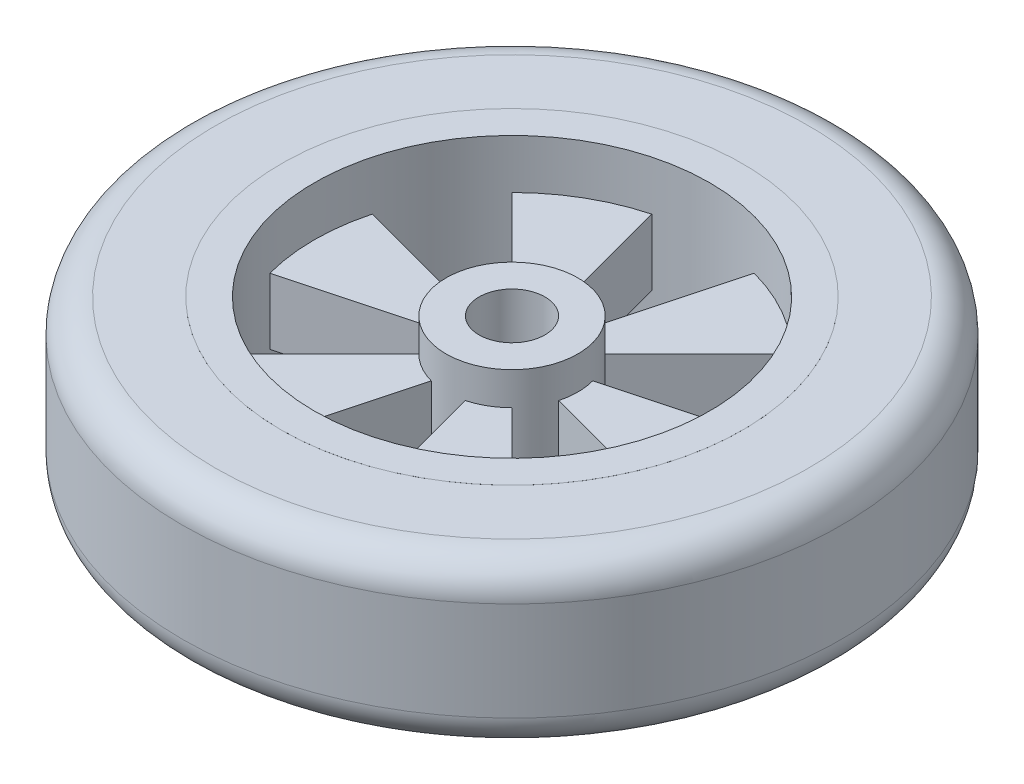
ISO-10303-21;
HEADER;
FILE_DESCRIPTION(('STEP AP214'),'2;1');
FILE_NAME('part.step','',(''),(''),'','','');
FILE_SCHEMA(('AUTOMOTIVE_DESIGN { 1 0 10303 214 1 1 1 1 }'));
ENDSEC;
DATA;
#1=APPLICATION_CONTEXT('core data for automotive mechanical design processes');
#2=APPLICATION_PROTOCOL_DEFINITION('international standard','automotive_design',2000,#1);
#3=PRODUCT_CONTEXT('',#1,'mechanical');
#4=PRODUCT('Part','Part','',(#3));
#5=PRODUCT_RELATED_PRODUCT_CATEGORY('part','',(#4));
#6=PRODUCT_DEFINITION_FORMATION('','',#4);
#7=PRODUCT_DEFINITION_CONTEXT('part definition',#1,'design');
#8=PRODUCT_DEFINITION('design','',#6,#7);
#9=PRODUCT_DEFINITION_SHAPE('','',#8);
#10=(LENGTH_UNIT() NAMED_UNIT(*) SI_UNIT(.MILLI.,.METRE.));
#11=(NAMED_UNIT(*) PLANE_ANGLE_UNIT() SI_UNIT($,.RADIAN.));
#12=(NAMED_UNIT(*) SI_UNIT($,.STERADIAN.) SOLID_ANGLE_UNIT());
#13=UNCERTAINTY_MEASURE_WITH_UNIT(LENGTH_MEASURE(1.E-05),#10,'distance_accuracy_value','');
#14=(GEOMETRIC_REPRESENTATION_CONTEXT(3) GLOBAL_UNCERTAINTY_ASSIGNED_CONTEXT((#13)) GLOBAL_UNIT_ASSIGNED_CONTEXT((#10,
#11,#12)) REPRESENTATION_CONTEXT('',''));
#15=CARTESIAN_POINT('',(0.,0.,0.));
#16=DIRECTION('',(0.,0.,1.));
#17=DIRECTION('',(1.,0.,0.));
#18=AXIS2_PLACEMENT_3D('',#15,#16,#17);
#19=CARTESIAN_POINT('',(0.,-10.,0.));
#20=DIRECTION('',(0.,1.,0.));
#21=DIRECTION('',(0.,0.,1.));
#22=AXIS2_PLACEMENT_3D('',#19,#20,#21);
#23=CYLINDRICAL_SURFACE('',#22,70.);
#24=CARTESIAN_POINT('',(0.,-25.,0.));
#25=DIRECTION('',(0.,1.,0.));
#26=DIRECTION('',(0.,0.,1.));
#27=AXIS2_PLACEMENT_3D('',#24,#25,#26);
#28=CIRCLE('',#27,70.);
#29=CARTESIAN_POINT('',(0.,-25.,70.));
#30=VERTEX_POINT('',#29);
#31=EDGE_CURVE('E326',#30,#30,#28,.T.);
#32=ORIENTED_EDGE('',*,*,#31,.T.);
#33=EDGE_LOOP('',(#32));
#34=FACE_BOUND('',#33,.T.);
#35=CARTESIAN_POINT('',(0.,-24.99,0.));
#36=DIRECTION('',(0.,1.,0.));
#37=DIRECTION('',(0.,0.,1.));
#38=AXIS2_PLACEMENT_3D('',#35,#36,#37);
#39=CIRCLE('',#38,70.);
#40=CARTESIAN_POINT('',(0.,-24.99,70.));
#41=VERTEX_POINT('',#40);
#42=EDGE_CURVE('E547',#41,#41,#39,.T.);
#43=ORIENTED_EDGE('',*,*,#42,.F.);
#44=EDGE_LOOP('',(#43));
#45=FACE_BOUND('',#44,.T.);
#46=ADVANCED_FACE('F35',(#34,#45),#23,.T.);
#47=CARTESIAN_POINT('',(0.,-10.,0.));
#48=DIRECTION('',(0.,1.,0.));
#49=DIRECTION('',(0.,0.,1.));
#50=AXIS2_PLACEMENT_3D('',#47,#48,#49);
#51=PLANE('',#50);
#52=DIRECTION('',(0.258819045102521,0.,-0.965925826289068));
#53=VECTOR('',#52,1.);
#54=CARTESIAN_POINT('',(0.,-10.,0.));
#55=LINE('',#54,#53);
#56=CARTESIAN_POINT('',(-15.5291427061513,-10.,57.9555495773441));
#57=VERTEX_POINT('',#56);
#58=CARTESIAN_POINT('',(-5.17638090205042,-10.,19.3185165257814));
#59=VERTEX_POINT('',#58);
#60=EDGE_CURVE('E283',#57,#59,#55,.T.);
#61=ORIENTED_EDGE('',*,*,#60,.F.);
#62=CARTESIAN_POINT('',(0.,-10.,0.));
#63=DIRECTION('',(0.,1.,0.));
#64=DIRECTION('',(0.,0.,1.));
#65=AXIS2_PLACEMENT_3D('',#62,#63,#64);
#66=CIRCLE('',#65,60.);
#67=CARTESIAN_POINT('',(-42.4264068711935,-10.,42.4264068711922));
#68=VERTEX_POINT('',#67);
#69=EDGE_CURVE('E239',#68,#57,#66,.T.);
#70=ORIENTED_EDGE('',*,*,#69,.F.);
#71=DIRECTION('',(-0.707106781186559,0.,0.707106781186536));
#72=VECTOR('',#71,1.);
#73=CARTESIAN_POINT('',(0.,-10.,0.));
#74=LINE('',#73,#72);
#75=CARTESIAN_POINT('',(-14.1421356237312,-10.,14.1421356237307));
#76=VERTEX_POINT('',#75);
#77=EDGE_CURVE('E502',#76,#68,#74,.T.);
#78=ORIENTED_EDGE('',*,*,#77,.F.);
#79=CARTESIAN_POINT('',(0.,-10.,0.));
#80=DIRECTION('',(0.,1.,0.));
#81=DIRECTION('',(0.,0.,1.));
#82=AXIS2_PLACEMENT_3D('',#79,#80,#81);
#83=CIRCLE('',#82,20.);
#84=EDGE_CURVE('E474',#76,#59,#83,.T.);
#85=ORIENTED_EDGE('',*,*,#84,.T.);
#86=EDGE_LOOP('',(#61,#70,#78,#85));
#87=FACE_BOUND('',#86,.T.);
#88=ADVANCED_FACE('F402',(#87),#51,.F.);
#89=DIRECTION('',(0.258819045102514,0.,0.96592582628907));
#90=VECTOR('',#89,1.);
#91=CARTESIAN_POINT('',(0.,-10.,0.));
#92=LINE('',#91,#90);
#93=CARTESIAN_POINT('',(5.1763809020503,-10.,19.3185165257814));
#94=VERTEX_POINT('',#93);
#95=CARTESIAN_POINT('',(15.5291427061509,-10.,57.9555495773442));
#96=VERTEX_POINT('',#95);
#97=EDGE_CURVE('E263',#94,#96,#92,.T.);
#98=ORIENTED_EDGE('',*,*,#97,.F.);
#99=CARTESIAN_POINT('',(14.1421356237309,-10.,14.142135623731));
#100=VERTEX_POINT('',#99);
#101=EDGE_CURVE('E266',#94,#100,#83,.T.);
#102=ORIENTED_EDGE('',*,*,#101,.T.);
#103=DIRECTION('',(-0.707106781186544,0.,-0.707106781186551));
#104=VECTOR('',#103,1.);
#105=CARTESIAN_POINT('',(0.,-10.,0.));
#106=LINE('',#105,#104);
#107=CARTESIAN_POINT('',(42.4264068711927,-10.,42.4264068711931));
#108=VERTEX_POINT('',#107);
#109=EDGE_CURVE('E265',#108,#100,#106,.T.);
#110=ORIENTED_EDGE('',*,*,#109,.F.);
#111=EDGE_CURVE('E223',#96,#108,#66,.T.);
#112=ORIENTED_EDGE('',*,*,#111,.F.);
#113=EDGE_LOOP('',(#98,#102,#110,#112));
#114=FACE_BOUND('',#113,.T.);
#115=ADVANCED_FACE('F261',(#114),#51,.F.);
#116=DIRECTION('',(0.965925826289066,0.,0.258819045102532));
#117=VECTOR('',#116,1.);
#118=CARTESIAN_POINT('',(0.,-10.,0.));
#119=LINE('',#118,#117);
#120=CARTESIAN_POINT('',(19.3185165257813,-10.,5.17638090205062));
#121=VERTEX_POINT('',#120);
#122=CARTESIAN_POINT('',(57.955549577344,-10.,15.5291427061519));
#123=VERTEX_POINT('',#122);
#124=EDGE_CURVE('E275',#121,#123,#119,.T.);
#125=ORIENTED_EDGE('',*,*,#124,.F.);
#126=CARTESIAN_POINT('',(19.3185165257814,-10.,-5.17638090205037));
#127=VERTEX_POINT('',#126);
#128=EDGE_CURVE('E468',#121,#127,#83,.T.);
#129=ORIENTED_EDGE('',*,*,#128,.T.);
#130=DIRECTION('',(-0.965925826289069,0.,0.258819045102518));
#131=VECTOR('',#130,1.);
#132=CARTESIAN_POINT('',(0.,-10.,0.));
#133=LINE('',#132,#131);
#134=CARTESIAN_POINT('',(57.9555495773442,-10.,-15.5291427061511));
#135=VERTEX_POINT('',#134);
#136=EDGE_CURVE('E493',#135,#127,#133,.T.);
#137=ORIENTED_EDGE('',*,*,#136,.F.);
#138=EDGE_CURVE('E218',#123,#135,#66,.T.);
#139=ORIENTED_EDGE('',*,*,#138,.F.);
#140=EDGE_LOOP('',(#125,#129,#137,#139));
#141=FACE_BOUND('',#140,.T.);
#142=ADVANCED_FACE('F491',(#141),#51,.F.);
#143=DIRECTION('',(0.965925826289071,0.,-0.258819045102511));
#144=VECTOR('',#143,1.);
#145=CARTESIAN_POINT('',(0.,-10.,0.));
#146=LINE('',#145,#144);
#147=CARTESIAN_POINT('',(-57.9555495773443,-10.,15.5291427061507));
#148=VERTEX_POINT('',#147);
#149=CARTESIAN_POINT('',(-19.3185165257814,-10.,5.17638090205023));
#150=VERTEX_POINT('',#149);
#151=EDGE_CURVE('E495',#148,#150,#146,.T.);
#152=ORIENTED_EDGE('',*,*,#151,.F.);
#153=CARTESIAN_POINT('',(-57.9555495773438,-10.,-15.5291427061523));
#154=VERTEX_POINT('',#153);
#155=EDGE_CURVE('E230',#154,#148,#66,.T.);
#156=ORIENTED_EDGE('',*,*,#155,.F.);
#157=DIRECTION('',(-0.965925826289064,0.,-0.258819045102538));
#158=VECTOR('',#157,1.);
#159=CARTESIAN_POINT('',(0.,-10.,0.));
#160=LINE('',#159,#158);
#161=CARTESIAN_POINT('',(-19.3185165257813,-10.,-5.17638090205076));
#162=VERTEX_POINT('',#161);
#163=EDGE_CURVE('E512',#162,#154,#160,.T.);
#164=ORIENTED_EDGE('',*,*,#163,.F.);
#165=EDGE_CURVE('E318',#162,#150,#83,.T.);
#166=ORIENTED_EDGE('',*,*,#165,.T.);
#167=EDGE_LOOP('',(#152,#156,#164,#166));
#168=FACE_BOUND('',#167,.T.);
#169=ADVANCED_FACE('F610',(#168),#51,.F.);
#170=DIRECTION('',(0.707106781186539,0.,0.707106781186556));
#171=VECTOR('',#170,1.);
#172=CARTESIAN_POINT('',(0.,-10.,0.));
#173=LINE('',#172,#171);
#174=CARTESIAN_POINT('',(-42.4264068711924,-10.,-42.4264068711934));
#175=VERTEX_POINT('',#174);
#176=CARTESIAN_POINT('',(-14.1421356237308,-10.,-14.1421356237311));
#177=VERTEX_POINT('',#176);
#178=EDGE_CURVE('E507',#175,#177,#173,.T.);
#179=ORIENTED_EDGE('',*,*,#178,.F.);
#180=CARTESIAN_POINT('',(-15.5291427061509,-10.,-57.9555495773442));
#181=VERTEX_POINT('',#180);
#182=EDGE_CURVE('E221',#181,#175,#66,.T.);
#183=ORIENTED_EDGE('',*,*,#182,.F.);
#184=DIRECTION('',(-0.258819045102514,0.,-0.96592582628907));
#185=VECTOR('',#184,1.);
#186=CARTESIAN_POINT('',(0.,-10.,0.));
#187=LINE('',#186,#185);
#188=CARTESIAN_POINT('',(-5.1763809020503,-10.,-19.3185165257814));
#189=VERTEX_POINT('',#188);
#190=EDGE_CURVE('E297',#189,#181,#187,.T.);
#191=ORIENTED_EDGE('',*,*,#190,.F.);
#192=EDGE_CURVE('E314',#189,#177,#83,.T.);
#193=ORIENTED_EDGE('',*,*,#192,.T.);
#194=EDGE_LOOP('',(#179,#183,#191,#193));
#195=FACE_BOUND('',#194,.T.);
#196=ADVANCED_FACE('F419',(#195),#51,.F.);
#197=DIRECTION('',(0.707106781186554,0.,-0.707106781186541));
#198=VECTOR('',#197,1.);
#199=CARTESIAN_POINT('',(0.,-10.,0.));
#200=LINE('',#199,#198);
#201=CARTESIAN_POINT('',(14.1421356237311,-10.,-14.1421356237308));
#202=VERTEX_POINT('',#201);
#203=CARTESIAN_POINT('',(42.4264068711932,-10.,-42.4264068711925));
#204=VERTEX_POINT('',#203);
#205=EDGE_CURVE('E194',#202,#204,#200,.T.);
#206=ORIENTED_EDGE('',*,*,#205,.F.);
#207=CARTESIAN_POINT('',(5.17638090205042,-10.,-19.3185165257814));
#208=VERTEX_POINT('',#207);
#209=EDGE_CURVE('E313',#202,#208,#83,.T.);
#210=ORIENTED_EDGE('',*,*,#209,.T.);
#211=DIRECTION('',(-0.258819045102521,0.,0.965925826289068));
#212=VECTOR('',#211,1.);
#213=CARTESIAN_POINT('',(0.,-10.,0.));
#214=LINE('',#213,#212);
#215=CARTESIAN_POINT('',(15.5291427061513,-10.,-57.9555495773441));
#216=VERTEX_POINT('',#215);
#217=EDGE_CURVE('E217',#216,#208,#214,.T.);
#218=ORIENTED_EDGE('',*,*,#217,.F.);
#219=EDGE_CURVE('E209',#204,#216,#66,.T.);
#220=ORIENTED_EDGE('',*,*,#219,.F.);
#221=EDGE_LOOP('',(#206,#210,#218,#220));
#222=FACE_BOUND('',#221,.T.);
#223=ADVANCED_FACE('F215',(#222),#51,.F.);
#224=CARTESIAN_POINT('',(0.,10.,0.));
#225=DIRECTION('',(0.,1.,0.));
#226=DIRECTION('',(0.,0.,1.));
#227=AXIS2_PLACEMENT_3D('',#224,#225,#226);
#228=PLANE('',#227);
#229=CARTESIAN_POINT('',(0.,10.,0.));
#230=DIRECTION('',(0.,1.,0.));
#231=DIRECTION('',(0.,0.,1.));
#232=AXIS2_PLACEMENT_3D('',#229,#230,#231);
#233=CIRCLE('',#232,60.);
#234=CARTESIAN_POINT('',(-42.4264068711935,10.,42.4264068711922));
#235=VERTEX_POINT('',#234);
#236=CARTESIAN_POINT('',(-15.5291427061513,10.,57.9555495773441));
#237=VERTEX_POINT('',#236);
#238=EDGE_CURVE('E608',#235,#237,#233,.T.);
#239=ORIENTED_EDGE('',*,*,#238,.T.);
#240=DIRECTION('',(0.258819045102521,0.,-0.965925826289068));
#241=VECTOR('',#240,1.);
#242=CARTESIAN_POINT('',(0.,10.,0.));
#243=LINE('',#242,#241);
#244=CARTESIAN_POINT('',(-5.17638090205042,10.,19.3185165257814));
#245=VERTEX_POINT('',#244);
#246=EDGE_CURVE('E280',#237,#245,#243,.T.);
#247=ORIENTED_EDGE('',*,*,#246,.T.);
#248=CARTESIAN_POINT('',(0.,10.,0.));
#249=DIRECTION('',(0.,1.,0.));
#250=DIRECTION('',(0.,0.,1.));
#251=AXIS2_PLACEMENT_3D('',#248,#249,#250);
#252=CIRCLE('',#251,20.);
#253=CARTESIAN_POINT('',(-14.1421356237312,10.,14.1421356237307));
#254=VERTEX_POINT('',#253);
#255=EDGE_CURVE('E601',#254,#245,#252,.T.);
#256=ORIENTED_EDGE('',*,*,#255,.F.);
#257=DIRECTION('',(-0.707106781186559,0.,0.707106781186536));
#258=VECTOR('',#257,1.);
#259=CARTESIAN_POINT('',(0.,10.,0.));
#260=LINE('',#259,#258);
#261=EDGE_CURVE('E504',#254,#235,#260,.T.);
#262=ORIENTED_EDGE('',*,*,#261,.T.);
#263=EDGE_LOOP('',(#239,#247,#256,#262));
#264=FACE_BOUND('',#263,.T.);
#265=ADVANCED_FACE('F409',(#264),#228,.T.);
#266=CARTESIAN_POINT('',(5.1763809020503,10.,19.3185165257814));
#267=VERTEX_POINT('',#266);
#268=CARTESIAN_POINT('',(14.1421356237309,10.,14.142135623731));
#269=VERTEX_POINT('',#268);
#270=EDGE_CURVE('E599',#267,#269,#252,.T.);
#271=ORIENTED_EDGE('',*,*,#270,.F.);
#272=DIRECTION('',(0.258819045102514,0.,0.96592582628907));
#273=VECTOR('',#272,1.);
#274=CARTESIAN_POINT('',(0.,10.,0.));
#275=LINE('',#274,#273);
#276=CARTESIAN_POINT('',(15.5291427061509,10.,57.9555495773442));
#277=VERTEX_POINT('',#276);
#278=EDGE_CURVE('E269',#267,#277,#275,.T.);
#279=ORIENTED_EDGE('',*,*,#278,.T.);
#280=CARTESIAN_POINT('',(42.4264068711927,10.,42.4264068711931));
#281=VERTEX_POINT('',#280);
#282=EDGE_CURVE('E334',#277,#281,#233,.T.);
#283=ORIENTED_EDGE('',*,*,#282,.T.);
#284=DIRECTION('',(-0.707106781186544,0.,-0.707106781186551));
#285=VECTOR('',#284,1.);
#286=CARTESIAN_POINT('',(0.,10.,0.));
#287=LINE('',#286,#285);
#288=EDGE_CURVE('E270',#281,#269,#287,.T.);
#289=ORIENTED_EDGE('',*,*,#288,.T.);
#290=EDGE_LOOP('',(#271,#279,#283,#289));
#291=FACE_BOUND('',#290,.T.);
#292=ADVANCED_FACE('F411',(#291),#228,.T.);
#293=CARTESIAN_POINT('',(19.3185165257813,10.,5.17638090205062));
#294=VERTEX_POINT('',#293);
#295=CARTESIAN_POINT('',(19.3185165257814,10.,-5.17638090205037));
#296=VERTEX_POINT('',#295);
#297=EDGE_CURVE('E235',#294,#296,#252,.T.);
#298=ORIENTED_EDGE('',*,*,#297,.F.);
#299=DIRECTION('',(0.965925826289066,0.,0.258819045102532));
#300=VECTOR('',#299,1.);
#301=CARTESIAN_POINT('',(0.,10.,0.));
#302=LINE('',#301,#300);
#303=CARTESIAN_POINT('',(57.955549577344,10.,15.5291427061519));
#304=VERTEX_POINT('',#303);
#305=EDGE_CURVE('E494',#294,#304,#302,.T.);
#306=ORIENTED_EDGE('',*,*,#305,.T.);
#307=CARTESIAN_POINT('',(57.9555495773442,10.,-15.5291427061511));
#308=VERTEX_POINT('',#307);
#309=EDGE_CURVE('E330',#304,#308,#233,.T.);
#310=ORIENTED_EDGE('',*,*,#309,.T.);
#311=DIRECTION('',(-0.965925826289069,0.,0.258819045102518));
#312=VECTOR('',#311,1.);
#313=CARTESIAN_POINT('',(0.,10.,0.));
#314=LINE('',#313,#312);
#315=EDGE_CURVE('E201',#308,#296,#314,.T.);
#316=ORIENTED_EDGE('',*,*,#315,.T.);
#317=EDGE_LOOP('',(#298,#306,#310,#316));
#318=FACE_BOUND('',#317,.T.);
#319=ADVANCED_FACE('F417',(#318),#228,.T.);
#320=CARTESIAN_POINT('',(-57.9555495773438,10.,-15.5291427061523));
#321=VERTEX_POINT('',#320);
#322=CARTESIAN_POINT('',(-57.9555495773443,10.,15.5291427061507));
#323=VERTEX_POINT('',#322);
#324=EDGE_CURVE('E225',#321,#323,#233,.T.);
#325=ORIENTED_EDGE('',*,*,#324,.T.);
#326=DIRECTION('',(0.965925826289071,0.,-0.258819045102511));
#327=VECTOR('',#326,1.);
#328=CARTESIAN_POINT('',(0.,10.,0.));
#329=LINE('',#328,#327);
#330=CARTESIAN_POINT('',(-19.3185165257814,10.,5.17638090205023));
#331=VERTEX_POINT('',#330);
#332=EDGE_CURVE('E499',#323,#331,#329,.T.);
#333=ORIENTED_EDGE('',*,*,#332,.T.);
#334=CARTESIAN_POINT('',(-19.3185165257813,10.,-5.17638090205076));
#335=VERTEX_POINT('',#334);
#336=EDGE_CURVE('E338',#335,#331,#252,.T.);
#337=ORIENTED_EDGE('',*,*,#336,.F.);
#338=DIRECTION('',(-0.965925826289064,0.,-0.258819045102538));
#339=VECTOR('',#338,1.);
#340=CARTESIAN_POINT('',(0.,10.,0.));
#341=LINE('',#340,#339);
#342=EDGE_CURVE('E514',#335,#321,#341,.T.);
#343=ORIENTED_EDGE('',*,*,#342,.T.);
#344=EDGE_LOOP('',(#325,#333,#337,#343));
#345=FACE_BOUND('',#344,.T.);
#346=ADVANCED_FACE('F426',(#345),#228,.T.);
#347=CARTESIAN_POINT('',(-15.5291427061509,10.,-57.9555495773442));
#348=VERTEX_POINT('',#347);
#349=CARTESIAN_POINT('',(-42.4264068711924,10.,-42.4264068711934));
#350=VERTEX_POINT('',#349);
#351=EDGE_CURVE('E219',#348,#350,#233,.T.);
#352=ORIENTED_EDGE('',*,*,#351,.T.);
#353=DIRECTION('',(0.707106781186539,0.,0.707106781186556));
#354=VECTOR('',#353,1.);
#355=CARTESIAN_POINT('',(0.,10.,0.));
#356=LINE('',#355,#354);
#357=CARTESIAN_POINT('',(-14.1421356237308,10.,-14.1421356237311));
#358=VERTEX_POINT('',#357);
#359=EDGE_CURVE('E509',#350,#358,#356,.T.);
#360=ORIENTED_EDGE('',*,*,#359,.T.);
#361=CARTESIAN_POINT('',(-5.1763809020503,10.,-19.3185165257814));
#362=VERTEX_POINT('',#361);
#363=EDGE_CURVE('E237',#362,#358,#252,.T.);
#364=ORIENTED_EDGE('',*,*,#363,.F.);
#365=DIRECTION('',(-0.258819045102514,0.,-0.96592582628907));
#366=VECTOR('',#365,1.);
#367=CARTESIAN_POINT('',(0.,10.,0.));
#368=LINE('',#367,#366);
#369=EDGE_CURVE('E294',#362,#348,#368,.T.);
#370=ORIENTED_EDGE('',*,*,#369,.T.);
#371=EDGE_LOOP('',(#352,#360,#364,#370));
#372=FACE_BOUND('',#371,.T.);
#373=ADVANCED_FACE('F422',(#372),#228,.T.);
#374=CARTESIAN_POINT('',(14.1421356237311,10.,-14.1421356237308));
#375=VERTEX_POINT('',#374);
#376=CARTESIAN_POINT('',(5.17638090205042,10.,-19.3185165257814));
#377=VERTEX_POINT('',#376);
#378=EDGE_CURVE('E229',#375,#377,#252,.T.);
#379=ORIENTED_EDGE('',*,*,#378,.F.);
#380=DIRECTION('',(0.707106781186554,0.,-0.707106781186541));
#381=VECTOR('',#380,1.);
#382=CARTESIAN_POINT('',(0.,10.,0.));
#383=LINE('',#382,#381);
#384=CARTESIAN_POINT('',(42.4264068711932,10.,-42.4264068711925));
#385=VERTEX_POINT('',#384);
#386=EDGE_CURVE('E202',#375,#385,#383,.T.);
#387=ORIENTED_EDGE('',*,*,#386,.T.);
#388=CARTESIAN_POINT('',(15.5291427061513,10.,-57.9555495773441));
#389=VERTEX_POINT('',#388);
#390=EDGE_CURVE('E211',#385,#389,#233,.T.);
#391=ORIENTED_EDGE('',*,*,#390,.T.);
#392=DIRECTION('',(-0.258819045102521,0.,0.965925826289068));
#393=VECTOR('',#392,1.);
#394=CARTESIAN_POINT('',(0.,10.,0.));
#395=LINE('',#394,#393);
#396=EDGE_CURVE('E299',#389,#377,#395,.T.);
#397=ORIENTED_EDGE('',*,*,#396,.T.);
#398=EDGE_LOOP('',(#379,#387,#391,#397));
#399=FACE_BOUND('',#398,.T.);
#400=ADVANCED_FACE('F391',(#399),#228,.T.);
#401=CARTESIAN_POINT('',(0.,-25.,0.));
#402=DIRECTION('',(0.,1.,0.));
#403=DIRECTION('',(0.,0.,1.));
#404=AXIS2_PLACEMENT_3D('',#401,#402,#403);
#405=CYLINDRICAL_SURFACE('',#404,60.);
#406=ORIENTED_EDGE('',*,*,#69,.T.);
#407=DIRECTION('',(0.,-1.,0.));
#408=VECTOR('',#407,1.);
#409=CARTESIAN_POINT('',(-15.5291427061513,25.,57.9555495773441));
#410=LINE('',#409,#408);
#411=EDGE_CURVE('E533',#237,#57,#410,.T.);
#412=ORIENTED_EDGE('',*,*,#411,.F.);
#413=ORIENTED_EDGE('',*,*,#238,.F.);
#414=DIRECTION('',(0.,-1.,0.));
#415=VECTOR('',#414,1.);
#416=CARTESIAN_POINT('',(-42.4264068711935,25.,42.4264068711922));
#417=LINE('',#416,#415);
#418=EDGE_CURVE('E551',#235,#68,#417,.T.);
#419=ORIENTED_EDGE('',*,*,#418,.T.);
#420=EDGE_LOOP('',(#406,#412,#413,#419));
#421=FACE_BOUND('',#420,.T.);
#422=ORIENTED_EDGE('',*,*,#111,.T.);
#423=DIRECTION('',(0.,-1.,0.));
#424=VECTOR('',#423,1.);
#425=CARTESIAN_POINT('',(42.4264068711927,25.,42.4264068711931));
#426=LINE('',#425,#424);
#427=EDGE_CURVE('E255',#281,#108,#426,.T.);
#428=ORIENTED_EDGE('',*,*,#427,.F.);
#429=ORIENTED_EDGE('',*,*,#282,.F.);
#430=DIRECTION('',(0.,-1.,0.));
#431=VECTOR('',#430,1.);
#432=CARTESIAN_POINT('',(15.5291427061509,25.,57.9555495773442));
#433=LINE('',#432,#431);
#434=EDGE_CURVE('E257',#277,#96,#433,.T.);
#435=ORIENTED_EDGE('',*,*,#434,.T.);
#436=EDGE_LOOP('',(#422,#428,#429,#435));
#437=FACE_BOUND('',#436,.T.);
#438=ORIENTED_EDGE('',*,*,#155,.T.);
#439=DIRECTION('',(0.,-1.,0.));
#440=VECTOR('',#439,1.);
#441=CARTESIAN_POINT('',(-57.9555495773443,25.,15.5291427061507));
#442=LINE('',#441,#440);
#443=EDGE_CURVE('E549',#323,#148,#442,.T.);
#444=ORIENTED_EDGE('',*,*,#443,.F.);
#445=ORIENTED_EDGE('',*,*,#324,.F.);
#446=DIRECTION('',(0.,-1.,0.));
#447=VECTOR('',#446,1.);
#448=CARTESIAN_POINT('',(-57.9555495773438,25.,-15.5291427061523));
#449=LINE('',#448,#447);
#450=EDGE_CURVE('E544',#321,#154,#449,.T.);
#451=ORIENTED_EDGE('',*,*,#450,.T.);
#452=EDGE_LOOP('',(#438,#444,#445,#451));
#453=FACE_BOUND('',#452,.T.);
#454=ORIENTED_EDGE('',*,*,#182,.T.);
#455=DIRECTION('',(0.,-1.,0.));
#456=VECTOR('',#455,1.);
#457=CARTESIAN_POINT('',(-42.4264068711924,25.,-42.4264068711934));
#458=LINE('',#457,#456);
#459=EDGE_CURVE('E542',#350,#175,#458,.T.);
#460=ORIENTED_EDGE('',*,*,#459,.F.);
#461=ORIENTED_EDGE('',*,*,#351,.F.);
#462=DIRECTION('',(0.,-1.,0.));
#463=VECTOR('',#462,1.);
#464=CARTESIAN_POINT('',(-15.5291427061509,25.,-57.9555495773442));
#465=LINE('',#464,#463);
#466=EDGE_CURVE('E287',#348,#181,#465,.T.);
#467=ORIENTED_EDGE('',*,*,#466,.T.);
#468=EDGE_LOOP('',(#454,#460,#461,#467));
#469=FACE_BOUND('',#468,.T.);
#470=ORIENTED_EDGE('',*,*,#138,.T.);
#471=DIRECTION('',(0.,-1.,0.));
#472=VECTOR('',#471,1.);
#473=CARTESIAN_POINT('',(57.9555495773442,25.,-15.5291427061511));
#474=LINE('',#473,#472);
#475=EDGE_CURVE('E212',#308,#135,#474,.T.);
#476=ORIENTED_EDGE('',*,*,#475,.F.);
#477=ORIENTED_EDGE('',*,*,#309,.F.);
#478=DIRECTION('',(0.,-1.,0.));
#479=VECTOR('',#478,1.);
#480=CARTESIAN_POINT('',(57.955549577344,25.,15.5291427061519));
#481=LINE('',#480,#479);
#482=EDGE_CURVE('E58',#304,#123,#481,.T.);
#483=ORIENTED_EDGE('',*,*,#482,.T.);
#484=EDGE_LOOP('',(#470,#476,#477,#483));
#485=FACE_BOUND('',#484,.T.);
#486=DIRECTION('',(0.,-1.,0.));
#487=VECTOR('',#486,1.);
#488=CARTESIAN_POINT('',(42.4264068711932,25.,-42.4264068711925));
#489=LINE('',#488,#487);
#490=EDGE_CURVE('E50',#385,#204,#489,.T.);
#491=ORIENTED_EDGE('',*,*,#490,.T.);
#492=ORIENTED_EDGE('',*,*,#219,.T.);
#493=DIRECTION('',(0.,-1.,0.));
#494=VECTOR('',#493,1.);
#495=CARTESIAN_POINT('',(15.5291427061513,25.,-57.9555495773441));
#496=LINE('',#495,#494);
#497=EDGE_CURVE('E289',#389,#216,#496,.T.);
#498=ORIENTED_EDGE('',*,*,#497,.F.);
#499=ORIENTED_EDGE('',*,*,#390,.F.);
#500=EDGE_LOOP('',(#491,#492,#498,#499));
#501=FACE_BOUND('',#500,.T.);
#502=CARTESIAN_POINT('',(0.,25.,0.));
#503=DIRECTION('',(0.,1.,0.));
#504=DIRECTION('',(0.,0.,1.));
#505=AXIS2_PLACEMENT_3D('',#502,#503,#504);
#506=CIRCLE('',#505,60.);
#507=CARTESIAN_POINT('',(0.,25.,60.));
#508=VERTEX_POINT('',#507);
#509=EDGE_CURVE('E317',#508,#508,#506,.T.);
#510=ORIENTED_EDGE('',*,*,#509,.T.);
#511=EDGE_LOOP('',(#510));
#512=FACE_BOUND('',#511,.T.);
#513=CARTESIAN_POINT('',(0.,-25.,0.));
#514=DIRECTION('',(0.,1.,0.));
#515=DIRECTION('',(0.,0.,1.));
#516=AXIS2_PLACEMENT_3D('',#513,#514,#515);
#517=CIRCLE('',#516,60.);
#518=CARTESIAN_POINT('',(0.,-25.,60.));
#519=VERTEX_POINT('',#518);
#520=EDGE_CURVE('E324',#519,#519,#517,.T.);
#521=ORIENTED_EDGE('',*,*,#520,.F.);
#522=EDGE_LOOP('',(#521));
#523=FACE_BOUND('',#522,.T.);
#524=ADVANCED_FACE('F206',(#421,#437,#453,#469,#485,#501,#512,#523),#405,.F.);
#525=CARTESIAN_POINT('',(0.,-25.,0.));
#526=DIRECTION('',(0.,1.,0.));
#527=DIRECTION('',(0.,0.,1.));
#528=AXIS2_PLACEMENT_3D('',#525,#526,#527);
#529=PLANE('',#528);
#530=ORIENTED_EDGE('',*,*,#520,.T.);
#531=EDGE_LOOP('',(#530));
#532=FACE_BOUND('',#531,.T.);
#533=ORIENTED_EDGE('',*,*,#31,.F.);
#534=EDGE_LOOP('',(#533));
#535=FACE_BOUND('',#534,.T.);
#536=ADVANCED_FACE('F380',(#532,#535),#529,.F.);
#537=CARTESIAN_POINT('',(0.,24.99,0.));
#538=DIRECTION('',(0.,1.,0.));
#539=DIRECTION('',(0.,0.,1.));
#540=AXIS2_PLACEMENT_3D('',#537,#538,#539);
#541=CIRCLE('',#540,70.);
#542=CARTESIAN_POINT('',(0.,24.99,70.));
#543=VERTEX_POINT('',#542);
#544=EDGE_CURVE('E337',#543,#543,#541,.F.);
#545=ORIENTED_EDGE('',*,*,#544,.F.);
#546=EDGE_LOOP('',(#545));
#547=FACE_BOUND('',#546,.T.);
#548=CARTESIAN_POINT('',(0.,25.,0.));
#549=DIRECTION('',(0.,1.,0.));
#550=DIRECTION('',(0.,0.,1.));
#551=AXIS2_PLACEMENT_3D('',#548,#549,#550);
#552=CIRCLE('',#551,70.);
#553=CARTESIAN_POINT('',(0.,25.,70.));
#554=VERTEX_POINT('',#553);
#555=EDGE_CURVE('E321',#554,#554,#552,.T.);
#556=ORIENTED_EDGE('',*,*,#555,.F.);
#557=EDGE_LOOP('',(#556));
#558=FACE_BOUND('',#557,.T.);
#559=ADVANCED_FACE('F376',(#547,#558),#23,.T.);
#560=CARTESIAN_POINT('',(0.,25.,0.));
#561=DIRECTION('',(0.,1.,0.));
#562=DIRECTION('',(0.,0.,1.));
#563=AXIS2_PLACEMENT_3D('',#560,#561,#562);
#564=PLANE('',#563);
#565=ORIENTED_EDGE('',*,*,#555,.T.);
#566=EDGE_LOOP('',(#565));
#567=FACE_BOUND('',#566,.T.);
#568=ORIENTED_EDGE('',*,*,#509,.F.);
#569=EDGE_LOOP('',(#568));
#570=FACE_BOUND('',#569,.T.);
#571=ADVANCED_FACE('F379',(#567,#570),#564,.T.);
#572=CARTESIAN_POINT('',(0.,20.,0.));
#573=DIRECTION('',(0.,1.,0.));
#574=DIRECTION('',(0.,0.,1.));
#575=AXIS2_PLACEMENT_3D('',#572,#573,#574);
#576=PLANE('',#575);
#577=CARTESIAN_POINT('',(0.,20.,0.));
#578=DIRECTION('',(0.,1.,0.));
#579=DIRECTION('',(0.,0.,1.));
#580=AXIS2_PLACEMENT_3D('',#577,#578,#579);
#581=CIRCLE('',#580,10.);
#582=CARTESIAN_POINT('',(0.,20.,10.));
#583=VERTEX_POINT('',#582);
#584=EDGE_CURVE('E304',#583,#583,#581,.F.);
#585=ORIENTED_EDGE('',*,*,#584,.T.);
#586=EDGE_LOOP('',(#585));
#587=FACE_BOUND('',#586,.T.);
#588=CARTESIAN_POINT('',(0.,20.,0.));
#589=DIRECTION('',(0.,1.,0.));
#590=DIRECTION('',(0.,0.,1.));
#591=AXIS2_PLACEMENT_3D('',#588,#589,#590);
#592=CIRCLE('',#591,20.);
#593=CARTESIAN_POINT('',(0.,20.,20.));
#594=VERTEX_POINT('',#593);
#595=EDGE_CURVE('E307',#594,#594,#592,.T.);
#596=ORIENTED_EDGE('',*,*,#595,.T.);
#597=EDGE_LOOP('',(#596));
#598=FACE_BOUND('',#597,.T.);
#599=ADVANCED_FACE('F386',(#587,#598),#576,.T.);
#600=CARTESIAN_POINT('',(0.,-20.,0.));
#601=DIRECTION('',(0.,1.,0.));
#602=DIRECTION('',(0.,0.,1.));
#603=AXIS2_PLACEMENT_3D('',#600,#601,#602);
#604=CYLINDRICAL_SURFACE('',#603,20.);
#605=ORIENTED_EDGE('',*,*,#101,.F.);
#606=DIRECTION('',(0.,-1.,0.));
#607=VECTOR('',#606,1.);
#608=CARTESIAN_POINT('',(5.1763809020503,25.,19.3185165257814));
#609=LINE('',#608,#607);
#610=EDGE_CURVE('E536',#267,#94,#609,.T.);
#611=ORIENTED_EDGE('',*,*,#610,.F.);
#612=ORIENTED_EDGE('',*,*,#270,.T.);
#613=DIRECTION('',(0.,-1.,0.));
#614=VECTOR('',#613,1.);
#615=CARTESIAN_POINT('',(14.1421356237309,25.,14.142135623731));
#616=LINE('',#615,#614);
#617=EDGE_CURVE('E525',#269,#100,#616,.T.);
#618=ORIENTED_EDGE('',*,*,#617,.T.);
#619=EDGE_LOOP('',(#605,#611,#612,#618));
#620=FACE_BOUND('',#619,.T.);
#621=ORIENTED_EDGE('',*,*,#128,.F.);
#622=DIRECTION('',(0.,-1.,0.));
#623=VECTOR('',#622,1.);
#624=CARTESIAN_POINT('',(19.3185165257813,25.,5.17638090205062));
#625=LINE('',#624,#623);
#626=EDGE_CURVE('E529',#294,#121,#625,.T.);
#627=ORIENTED_EDGE('',*,*,#626,.F.);
#628=ORIENTED_EDGE('',*,*,#297,.T.);
#629=DIRECTION('',(0.,-1.,0.));
#630=VECTOR('',#629,1.);
#631=CARTESIAN_POINT('',(19.3185165257814,25.,-5.17638090205037));
#632=LINE('',#631,#630);
#633=EDGE_CURVE('E521',#296,#127,#632,.T.);
#634=ORIENTED_EDGE('',*,*,#633,.T.);
#635=EDGE_LOOP('',(#621,#627,#628,#634));
#636=FACE_BOUND('',#635,.T.);
#637=ORIENTED_EDGE('',*,*,#84,.F.);
#638=DIRECTION('',(0.,-1.,0.));
#639=VECTOR('',#638,1.);
#640=CARTESIAN_POINT('',(-14.1421356237312,25.,14.1421356237307));
#641=LINE('',#640,#639);
#642=EDGE_CURVE('E541',#254,#76,#641,.T.);
#643=ORIENTED_EDGE('',*,*,#642,.F.);
#644=ORIENTED_EDGE('',*,*,#255,.T.);
#645=DIRECTION('',(0.,-1.,0.));
#646=VECTOR('',#645,1.);
#647=CARTESIAN_POINT('',(-5.17638090205042,25.,19.3185165257814));
#648=LINE('',#647,#646);
#649=EDGE_CURVE('E531',#245,#59,#648,.T.);
#650=ORIENTED_EDGE('',*,*,#649,.T.);
#651=EDGE_LOOP('',(#637,#643,#644,#650));
#652=FACE_BOUND('',#651,.T.);
#653=ORIENTED_EDGE('',*,*,#165,.F.);
#654=DIRECTION('',(0.,-1.,0.));
#655=VECTOR('',#654,1.);
#656=CARTESIAN_POINT('',(-19.3185165257813,25.,-5.17638090205076));
#657=LINE('',#656,#655);
#658=EDGE_CURVE('E480',#335,#162,#657,.T.);
#659=ORIENTED_EDGE('',*,*,#658,.F.);
#660=ORIENTED_EDGE('',*,*,#336,.T.);
#661=DIRECTION('',(0.,-1.,0.));
#662=VECTOR('',#661,1.);
#663=CARTESIAN_POINT('',(-19.3185165257814,25.,5.17638090205023));
#664=LINE('',#663,#662);
#665=EDGE_CURVE('E482',#331,#150,#664,.T.);
#666=ORIENTED_EDGE('',*,*,#665,.T.);
#667=EDGE_LOOP('',(#653,#659,#660,#666));
#668=FACE_BOUND('',#667,.T.);
#669=ORIENTED_EDGE('',*,*,#209,.F.);
#670=DIRECTION('',(0.,-1.,0.));
#671=VECTOR('',#670,1.);
#672=CARTESIAN_POINT('',(14.1421356237311,25.,-14.1421356237308));
#673=LINE('',#672,#671);
#674=EDGE_CURVE('E197',#375,#202,#673,.T.);
#675=ORIENTED_EDGE('',*,*,#674,.F.);
#676=ORIENTED_EDGE('',*,*,#378,.T.);
#677=DIRECTION('',(0.,-1.,0.));
#678=VECTOR('',#677,1.);
#679=CARTESIAN_POINT('',(5.17638090205042,25.,-19.3185165257814));
#680=LINE('',#679,#678);
#681=EDGE_CURVE('E291',#377,#208,#680,.T.);
#682=ORIENTED_EDGE('',*,*,#681,.T.);
#683=EDGE_LOOP('',(#669,#675,#676,#682));
#684=FACE_BOUND('',#683,.T.);
#685=DIRECTION('',(0.,-1.,0.));
#686=VECTOR('',#685,1.);
#687=CARTESIAN_POINT('',(-14.1421356237308,25.,-14.1421356237311));
#688=LINE('',#687,#686);
#689=EDGE_CURVE('E538',#358,#177,#688,.T.);
#690=ORIENTED_EDGE('',*,*,#689,.T.);
#691=ORIENTED_EDGE('',*,*,#192,.F.);
#692=DIRECTION('',(0.,-1.,0.));
#693=VECTOR('',#692,1.);
#694=CARTESIAN_POINT('',(-5.1763809020503,25.,-19.3185165257814));
#695=LINE('',#694,#693);
#696=EDGE_CURVE('E285',#362,#189,#695,.T.);
#697=ORIENTED_EDGE('',*,*,#696,.F.);
#698=ORIENTED_EDGE('',*,*,#363,.T.);
#699=EDGE_LOOP('',(#690,#691,#697,#698));
#700=FACE_BOUND('',#699,.T.);
#701=ORIENTED_EDGE('',*,*,#595,.F.);
#702=EDGE_LOOP('',(#701));
#703=FACE_BOUND('',#702,.T.);
#704=CARTESIAN_POINT('',(0.,-20.,0.));
#705=DIRECTION('',(0.,1.,0.));
#706=DIRECTION('',(0.,0.,1.));
#707=AXIS2_PLACEMENT_3D('',#704,#705,#706);
#708=CIRCLE('',#707,20.);
#709=CARTESIAN_POINT('',(0.,-20.,20.));
#710=VERTEX_POINT('',#709);
#711=EDGE_CURVE('E310',#710,#710,#708,.T.);
#712=ORIENTED_EDGE('',*,*,#711,.T.);
#713=EDGE_LOOP('',(#712));
#714=FACE_BOUND('',#713,.T.);
#715=ADVANCED_FACE('F431',(#620,#636,#652,#668,#684,#700,#703,#714),#604,.T.);
#716=CARTESIAN_POINT('',(0.,-20.,0.));
#717=DIRECTION('',(0.,1.,0.));
#718=DIRECTION('',(0.,0.,1.));
#719=AXIS2_PLACEMENT_3D('',#716,#717,#718);
#720=PLANE('',#719);
#721=CARTESIAN_POINT('',(0.,-20.,0.));
#722=DIRECTION('',(0.,1.,0.));
#723=DIRECTION('',(0.,0.,1.));
#724=AXIS2_PLACEMENT_3D('',#721,#722,#723);
#725=CIRCLE('',#724,10.);
#726=CARTESIAN_POINT('',(0.,-20.,10.));
#727=VERTEX_POINT('',#726);
#728=EDGE_CURVE('E303',#727,#727,#725,.F.);
#729=ORIENTED_EDGE('',*,*,#728,.F.);
#730=EDGE_LOOP('',(#729));
#731=FACE_BOUND('',#730,.T.);
#732=ORIENTED_EDGE('',*,*,#711,.F.);
#733=EDGE_LOOP('',(#732));
#734=FACE_BOUND('',#733,.T.);
#735=ADVANCED_FACE('F446',(#731,#734),#720,.F.);
#736=CARTESIAN_POINT('',(0.,25.,0.));
#737=DIRECTION('',(0.,-1.,0.));
#738=DIRECTION('',(0.,0.,-1.));
#739=AXIS2_PLACEMENT_3D('',#736,#737,#738);
#740=CYLINDRICAL_SURFACE('',#739,10.);
#741=ORIENTED_EDGE('',*,*,#584,.F.);
#742=EDGE_LOOP('',(#741));
#743=FACE_BOUND('',#742,.T.);
#744=ORIENTED_EDGE('',*,*,#728,.T.);
#745=EDGE_LOOP('',(#744));
#746=FACE_BOUND('',#745,.T.);
#747=ADVANCED_FACE('F437',(#743,#746),#740,.F.);
#748=CARTESIAN_POINT('',(5.17638090205042,25.,-19.3185165257814));
#749=DIRECTION('',(-0.965925826289068,0.,-0.258819045102521));
#750=DIRECTION('',(-0.258819045102521,0.,0.965925826289068));
#751=AXIS2_PLACEMENT_3D('',#748,#749,#750);
#752=PLANE('',#751);
#753=ORIENTED_EDGE('',*,*,#217,.T.);
#754=ORIENTED_EDGE('',*,*,#681,.F.);
#755=ORIENTED_EDGE('',*,*,#396,.F.);
#756=ORIENTED_EDGE('',*,*,#497,.T.);
#757=EDGE_LOOP('',(#753,#754,#755,#756));
#758=FACE_BOUND('',#757,.T.);
#759=ADVANCED_FACE('F434',(#758),#752,.T.);
#760=CARTESIAN_POINT('',(-15.5291427061509,25.,-57.9555495773442));
#761=DIRECTION('',(0.96592582628907,0.,-0.258819045102514));
#762=DIRECTION('',(-0.258819045102514,0.,-0.96592582628907));
#763=AXIS2_PLACEMENT_3D('',#760,#761,#762);
#764=PLANE('',#763);
#765=ORIENTED_EDGE('',*,*,#190,.T.);
#766=ORIENTED_EDGE('',*,*,#466,.F.);
#767=ORIENTED_EDGE('',*,*,#369,.F.);
#768=ORIENTED_EDGE('',*,*,#696,.T.);
#769=EDGE_LOOP('',(#765,#766,#767,#768));
#770=FACE_BOUND('',#769,.T.);
#771=ADVANCED_FACE('F436',(#770),#764,.T.);
#772=CARTESIAN_POINT('',(19.3185165257814,25.,-5.17638090205037));
#773=DIRECTION('',(-0.258819045102518,0.,-0.965925826289069));
#774=DIRECTION('',(-0.965925826289069,0.,0.258819045102518));
#775=AXIS2_PLACEMENT_3D('',#772,#773,#774);
#776=PLANE('',#775);
#777=ORIENTED_EDGE('',*,*,#136,.T.);
#778=ORIENTED_EDGE('',*,*,#633,.F.);
#779=ORIENTED_EDGE('',*,*,#315,.F.);
#780=ORIENTED_EDGE('',*,*,#475,.T.);
#781=EDGE_LOOP('',(#777,#778,#779,#780));
#782=FACE_BOUND('',#781,.T.);
#783=ADVANCED_FACE('F443',(#782),#776,.T.);
#784=CARTESIAN_POINT('',(42.4264068711932,25.,-42.4264068711925));
#785=DIRECTION('',(0.707106781186541,0.,0.707106781186554));
#786=DIRECTION('',(0.707106781186554,0.,-0.707106781186541));
#787=AXIS2_PLACEMENT_3D('',#784,#785,#786);
#788=PLANE('',#787);
#789=ORIENTED_EDGE('',*,*,#205,.T.);
#790=ORIENTED_EDGE('',*,*,#490,.F.);
#791=ORIENTED_EDGE('',*,*,#386,.F.);
#792=ORIENTED_EDGE('',*,*,#674,.T.);
#793=EDGE_LOOP('',(#789,#790,#791,#792));
#794=FACE_BOUND('',#793,.T.);
#795=ADVANCED_FACE('F195',(#794),#788,.T.);
#796=CARTESIAN_POINT('',(-14.1421356237308,25.,-14.1421356237311));
#797=DIRECTION('',(-0.707106781186556,0.,0.707106781186539));
#798=DIRECTION('',(0.707106781186539,0.,0.707106781186556));
#799=AXIS2_PLACEMENT_3D('',#796,#797,#798);
#800=PLANE('',#799);
#801=ORIENTED_EDGE('',*,*,#178,.T.);
#802=ORIENTED_EDGE('',*,*,#689,.F.);
#803=ORIENTED_EDGE('',*,*,#359,.F.);
#804=ORIENTED_EDGE('',*,*,#459,.T.);
#805=EDGE_LOOP('',(#801,#802,#803,#804));
#806=FACE_BOUND('',#805,.T.);
#807=ADVANCED_FACE('F573',(#806),#800,.T.);
#808=CARTESIAN_POINT('',(-57.9555495773438,25.,-15.5291427061523));
#809=DIRECTION('',(0.258819045102538,0.,-0.965925826289064));
#810=DIRECTION('',(-0.965925826289064,0.,-0.258819045102538));
#811=AXIS2_PLACEMENT_3D('',#808,#809,#810);
#812=PLANE('',#811);
#813=ORIENTED_EDGE('',*,*,#163,.T.);
#814=ORIENTED_EDGE('',*,*,#450,.F.);
#815=ORIENTED_EDGE('',*,*,#342,.F.);
#816=ORIENTED_EDGE('',*,*,#658,.T.);
#817=EDGE_LOOP('',(#813,#814,#815,#816));
#818=FACE_BOUND('',#817,.T.);
#819=ADVANCED_FACE('F569',(#818),#812,.T.);
#820=CARTESIAN_POINT('',(-19.3185165257814,25.,5.17638090205023));
#821=DIRECTION('',(0.258819045102511,0.,0.965925826289071));
#822=DIRECTION('',(0.965925826289071,0.,-0.258819045102511));
#823=AXIS2_PLACEMENT_3D('',#820,#821,#822);
#824=PLANE('',#823);
#825=ORIENTED_EDGE('',*,*,#151,.T.);
#826=ORIENTED_EDGE('',*,*,#665,.F.);
#827=ORIENTED_EDGE('',*,*,#332,.F.);
#828=ORIENTED_EDGE('',*,*,#443,.T.);
#829=EDGE_LOOP('',(#825,#826,#827,#828));
#830=FACE_BOUND('',#829,.T.);
#831=ADVANCED_FACE('F565',(#830),#824,.T.);
#832=CARTESIAN_POINT('',(-42.4264068711935,25.,42.4264068711922));
#833=DIRECTION('',(-0.707106781186536,0.,-0.707106781186559));
#834=DIRECTION('',(-0.707106781186559,0.,0.707106781186536));
#835=AXIS2_PLACEMENT_3D('',#832,#833,#834);
#836=PLANE('',#835);
#837=ORIENTED_EDGE('',*,*,#77,.T.);
#838=ORIENTED_EDGE('',*,*,#418,.F.);
#839=ORIENTED_EDGE('',*,*,#261,.F.);
#840=ORIENTED_EDGE('',*,*,#642,.T.);
#841=EDGE_LOOP('',(#837,#838,#839,#840));
#842=FACE_BOUND('',#841,.T.);
#843=ADVANCED_FACE('F561',(#842),#836,.T.);
#844=CARTESIAN_POINT('',(14.1421356237309,25.,14.142135623731));
#845=DIRECTION('',(0.707106781186551,0.,-0.707106781186544));
#846=DIRECTION('',(-0.707106781186544,0.,-0.707106781186551));
#847=AXIS2_PLACEMENT_3D('',#844,#845,#846);
#848=PLANE('',#847);
#849=ORIENTED_EDGE('',*,*,#109,.T.);
#850=ORIENTED_EDGE('',*,*,#617,.F.);
#851=ORIENTED_EDGE('',*,*,#288,.F.);
#852=ORIENTED_EDGE('',*,*,#427,.T.);
#853=EDGE_LOOP('',(#849,#850,#851,#852));
#854=FACE_BOUND('',#853,.T.);
#855=ADVANCED_FACE('F564',(#854),#848,.T.);
#856=CARTESIAN_POINT('',(57.955549577344,25.,15.5291427061519));
#857=DIRECTION('',(-0.258819045102532,0.,0.965925826289065));
#858=DIRECTION('',(0.965925826289066,0.,0.258819045102532));
#859=AXIS2_PLACEMENT_3D('',#856,#857,#858);
#860=PLANE('',#859);
#861=ORIENTED_EDGE('',*,*,#124,.T.);
#862=ORIENTED_EDGE('',*,*,#482,.F.);
#863=ORIENTED_EDGE('',*,*,#305,.F.);
#864=ORIENTED_EDGE('',*,*,#626,.T.);
#865=EDGE_LOOP('',(#861,#862,#863,#864));
#866=FACE_BOUND('',#865,.T.);
#867=ADVANCED_FACE('F584',(#866),#860,.T.);
#868=CARTESIAN_POINT('',(-5.17638090205042,25.,19.3185165257814));
#869=DIRECTION('',(0.965925826289068,0.,0.258819045102521));
#870=DIRECTION('',(0.258819045102521,0.,-0.965925826289068));
#871=AXIS2_PLACEMENT_3D('',#868,#869,#870);
#872=PLANE('',#871);
#873=ORIENTED_EDGE('',*,*,#60,.T.);
#874=ORIENTED_EDGE('',*,*,#649,.F.);
#875=ORIENTED_EDGE('',*,*,#246,.F.);
#876=ORIENTED_EDGE('',*,*,#411,.T.);
#877=EDGE_LOOP('',(#873,#874,#875,#876));
#878=FACE_BOUND('',#877,.T.);
#879=ADVANCED_FACE('F580',(#878),#872,.T.);
#880=CARTESIAN_POINT('',(15.5291427061509,25.,57.9555495773442));
#881=DIRECTION('',(-0.96592582628907,0.,0.258819045102514));
#882=DIRECTION('',(0.258819045102514,0.,0.96592582628907));
#883=AXIS2_PLACEMENT_3D('',#880,#881,#882);
#884=PLANE('',#883);
#885=ORIENTED_EDGE('',*,*,#97,.T.);
#886=ORIENTED_EDGE('',*,*,#434,.F.);
#887=ORIENTED_EDGE('',*,*,#278,.F.);
#888=ORIENTED_EDGE('',*,*,#610,.T.);
#889=EDGE_LOOP('',(#885,#886,#887,#888));
#890=FACE_BOUND('',#889,.T.);
#891=ADVANCED_FACE('F363',(#890),#884,.T.);
#892=CARTESIAN_POINT('',(0.,-24.99,0.));
#893=DIRECTION('',(0.,1.,0.));
#894=DIRECTION('',(0.,0.,1.));
#895=AXIS2_PLACEMENT_3D('',#892,#893,#894);
#896=CYLINDRICAL_SURFACE('',#895,100.);
#897=CARTESIAN_POINT('',(0.,-14.99,0.));
#898=DIRECTION('',(0.,1.,0.));
#899=DIRECTION('',(0.,0.,1.));
#900=AXIS2_PLACEMENT_3D('',#897,#898,#899);
#901=CIRCLE('',#900,100.);
#902=CARTESIAN_POINT('',(0.,-14.99,100.));
#903=VERTEX_POINT('',#902);
#904=EDGE_CURVE('E346',#903,#903,#901,.T.);
#905=ORIENTED_EDGE('',*,*,#904,.T.);
#906=EDGE_LOOP('',(#905));
#907=FACE_BOUND('',#906,.T.);
#908=CARTESIAN_POINT('',(0.,14.99,0.));
#909=DIRECTION('',(0.,1.,0.));
#910=DIRECTION('',(0.,0.,1.));
#911=AXIS2_PLACEMENT_3D('',#908,#909,#910);
#912=CIRCLE('',#911,100.);
#913=CARTESIAN_POINT('',(0.,14.99,100.));
#914=VERTEX_POINT('',#913);
#915=EDGE_CURVE('E343',#914,#914,#912,.F.);
#916=ORIENTED_EDGE('',*,*,#915,.T.);
#917=EDGE_LOOP('',(#916));
#918=FACE_BOUND('',#917,.T.);
#919=ADVANCED_FACE('F360',(#907,#918),#896,.T.);
#920=CARTESIAN_POINT('',(0.,-24.99,0.));
#921=DIRECTION('',(0.,1.,0.));
#922=DIRECTION('',(0.,0.,1.));
#923=AXIS2_PLACEMENT_3D('',#920,#921,#922);
#924=PLANE('',#923);
#925=CARTESIAN_POINT('',(0.,-24.99,0.));
#926=DIRECTION('',(0.,1.,0.));
#927=DIRECTION('',(0.,0.,1.));
#928=AXIS2_PLACEMENT_3D('',#925,#926,#927);
#929=CIRCLE('',#928,90.);
#930=CARTESIAN_POINT('',(0.,-24.99,90.));
#931=VERTEX_POINT('',#930);
#932=EDGE_CURVE('E43',#931,#931,#929,.F.);
#933=ORIENTED_EDGE('',*,*,#932,.T.);
#934=EDGE_LOOP('',(#933));
#935=FACE_BOUND('',#934,.T.);
#936=ORIENTED_EDGE('',*,*,#42,.T.);
#937=EDGE_LOOP('',(#936));
#938=FACE_BOUND('',#937,.T.);
#939=ADVANCED_FACE('F351',(#935,#938),#924,.F.);
#940=CARTESIAN_POINT('',(0.,24.99,0.));
#941=DIRECTION('',(0.,1.,0.));
#942=DIRECTION('',(0.,0.,1.));
#943=AXIS2_PLACEMENT_3D('',#940,#941,#942);
#944=PLANE('',#943);
#945=CARTESIAN_POINT('',(0.,24.99,0.));
#946=DIRECTION('',(0.,1.,0.));
#947=DIRECTION('',(0.,0.,1.));
#948=AXIS2_PLACEMENT_3D('',#945,#946,#947);
#949=CIRCLE('',#948,90.);
#950=CARTESIAN_POINT('',(0.,24.99,90.));
#951=VERTEX_POINT('',#950);
#952=EDGE_CURVE('E11',#951,#951,#949,.T.);
#953=ORIENTED_EDGE('',*,*,#952,.T.);
#954=EDGE_LOOP('',(#953));
#955=FACE_BOUND('',#954,.T.);
#956=ORIENTED_EDGE('',*,*,#544,.T.);
#957=EDGE_LOOP('',(#956));
#958=FACE_BOUND('',#957,.T.);
#959=ADVANCED_FACE('F357',(#955,#958),#944,.T.);
#960=CARTESIAN_POINT('',(0.,-14.99,0.));
#961=DIRECTION('',(0.,1.,0.));
#962=DIRECTION('',(0.,0.,1.));
#963=AXIS2_PLACEMENT_3D('',#960,#961,#962);
#964=TOROIDAL_SURFACE('',#963,90.,10.);
#965=ORIENTED_EDGE('',*,*,#932,.F.);
#966=EDGE_LOOP('',(#965));
#967=FACE_BOUND('',#966,.T.);
#968=ORIENTED_EDGE('',*,*,#904,.F.);
#969=EDGE_LOOP('',(#968));
#970=FACE_BOUND('',#969,.T.);
#971=ADVANCED_FACE('F354',(#967,#970),#964,.T.);
#972=CARTESIAN_POINT('',(0.,14.99,0.));
#973=DIRECTION('',(0.,1.,0.));
#974=DIRECTION('',(0.,0.,1.));
#975=AXIS2_PLACEMENT_3D('',#972,#973,#974);
#976=TOROIDAL_SURFACE('',#975,90.,10.);
#977=ORIENTED_EDGE('',*,*,#915,.F.);
#978=EDGE_LOOP('',(#977));
#979=FACE_BOUND('',#978,.T.);
#980=ORIENTED_EDGE('',*,*,#952,.F.);
#981=EDGE_LOOP('',(#980));
#982=FACE_BOUND('',#981,.T.);
#983=ADVANCED_FACE('F37',(#979,#982),#976,.T.);
#984=CLOSED_SHELL('',(#46,#88,#115,#142,#169,#196,#223,#265,#292,#319,#346,#373,#400,#524,#536,
#559,#571,#599,#715,#735,#747,#759,#771,#783,#795,#807,#819,#831,#843,#855,#867,#879,#891,#919,
#939,#959,#971,#983));
#985=MANIFOLD_SOLID_BREP('B2',#984);
#986=ADVANCED_BREP_SHAPE_REPRESENTATION('',(#18,#985),#14);
#987=SHAPE_DEFINITION_REPRESENTATION(#9,#986);
ENDSEC;
END-ISO-10303-21;
